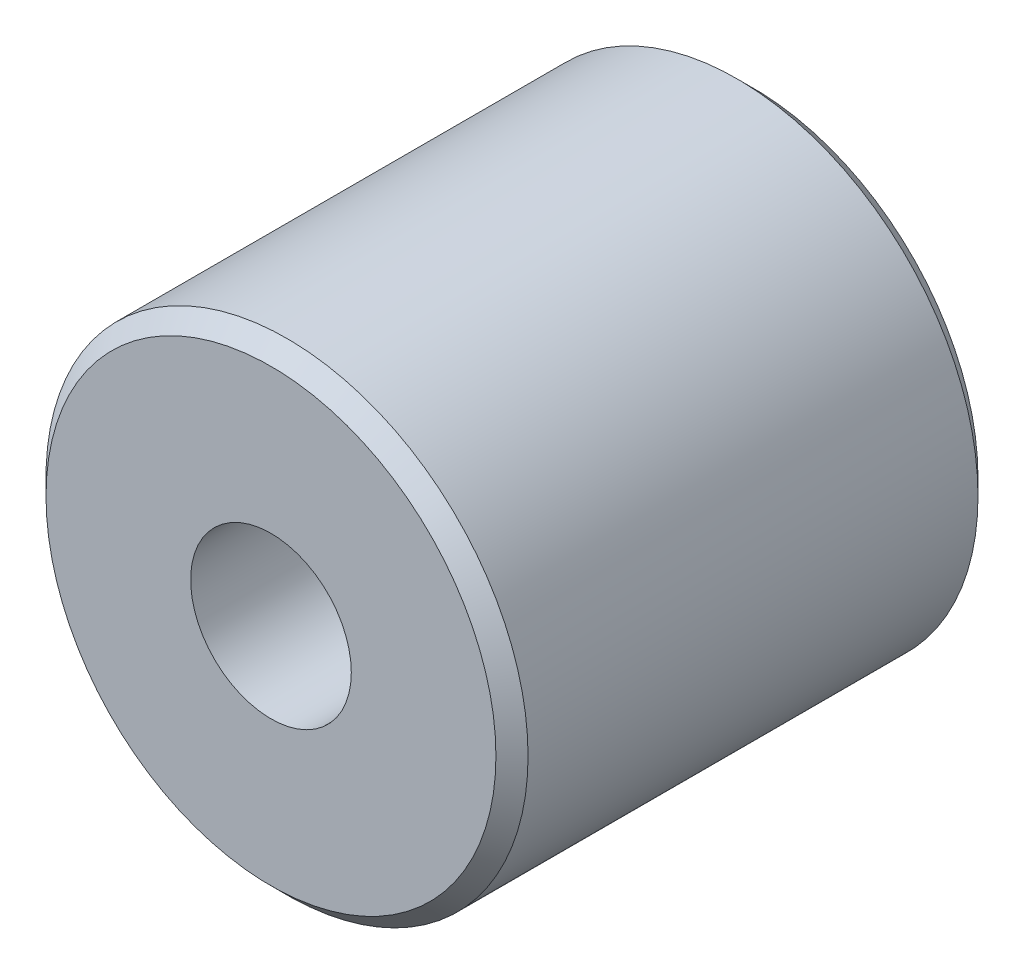
ISO-10303-21;
HEADER;
FILE_DESCRIPTION(('STEP AP214'),'2;1');
FILE_NAME('part.step','',(''),(''),'','','');
FILE_SCHEMA(('AUTOMOTIVE_DESIGN { 1 0 10303 214 1 1 1 1 }'));
ENDSEC;
DATA;
#1=APPLICATION_CONTEXT('core data for automotive mechanical design processes');
#2=APPLICATION_PROTOCOL_DEFINITION('international standard','automotive_design',2000,#1);
#3=PRODUCT_CONTEXT('',#1,'mechanical');
#4=PRODUCT('Part','Part','',(#3));
#5=PRODUCT_RELATED_PRODUCT_CATEGORY('part','',(#4));
#6=PRODUCT_DEFINITION_FORMATION('','',#4);
#7=PRODUCT_DEFINITION_CONTEXT('part definition',#1,'design');
#8=PRODUCT_DEFINITION('design','',#6,#7);
#9=PRODUCT_DEFINITION_SHAPE('','',#8);
#10=(LENGTH_UNIT() NAMED_UNIT(*) SI_UNIT(.MILLI.,.METRE.));
#11=(NAMED_UNIT(*) PLANE_ANGLE_UNIT() SI_UNIT($,.RADIAN.));
#12=(NAMED_UNIT(*) SI_UNIT($,.STERADIAN.) SOLID_ANGLE_UNIT());
#13=UNCERTAINTY_MEASURE_WITH_UNIT(LENGTH_MEASURE(1.E-05),#10,'distance_accuracy_value','');
#14=(GEOMETRIC_REPRESENTATION_CONTEXT(3) GLOBAL_UNCERTAINTY_ASSIGNED_CONTEXT((#13)) GLOBAL_UNIT_ASSIGNED_CONTEXT((#10,
#11,#12)) REPRESENTATION_CONTEXT('',''));
#15=CARTESIAN_POINT('',(0.,0.,0.));
#16=DIRECTION('',(0.,0.,1.));
#17=DIRECTION('',(1.,0.,0.));
#18=AXIS2_PLACEMENT_3D('',#15,#16,#17);
#19=CARTESIAN_POINT('',(0.,0.,30.));
#20=DIRECTION('',(0.,0.,1.));
#21=DIRECTION('',(1.,0.,0.));
#22=AXIS2_PLACEMENT_3D('',#19,#20,#21);
#23=PLANE('',#22);
#24=CARTESIAN_POINT('',(0.,0.,30.));
#25=DIRECTION('',(0.,0.,1.));
#26=DIRECTION('',(1.,0.,0.));
#27=AXIS2_PLACEMENT_3D('',#24,#25,#26);
#28=CIRCLE('',#27,14.);
#29=CARTESIAN_POINT('',(14.,0.,30.));
#30=VERTEX_POINT('',#29);
#31=EDGE_CURVE('E10',#30,#30,#28,.T.);
#32=ORIENTED_EDGE('',*,*,#31,.T.);
#33=EDGE_LOOP('',(#32));
#34=FACE_BOUND('',#33,.T.);
#35=CARTESIAN_POINT('',(0.,0.,30.));
#36=DIRECTION('',(0.,0.,1.));
#37=DIRECTION('',(1.,0.,0.));
#38=AXIS2_PLACEMENT_3D('',#35,#36,#37);
#39=CIRCLE('',#38,5.);
#40=CARTESIAN_POINT('',(5.,0.,30.));
#41=VERTEX_POINT('',#40);
#42=EDGE_CURVE('E51',#41,#41,#39,.T.);
#43=ORIENTED_EDGE('',*,*,#42,.F.);
#44=EDGE_LOOP('',(#43));
#45=FACE_BOUND('',#44,.T.);
#46=ADVANCED_FACE('F31',(#34,#45),#23,.T.);
#47=CARTESIAN_POINT('',(0.,0.,0.));
#48=DIRECTION('',(0.,0.,1.));
#49=DIRECTION('',(1.,0.,0.));
#50=AXIS2_PLACEMENT_3D('',#47,#48,#49);
#51=PLANE('',#50);
#52=CARTESIAN_POINT('',(0.,0.,0.));
#53=DIRECTION('',(0.,0.,1.));
#54=DIRECTION('',(1.,0.,0.));
#55=AXIS2_PLACEMENT_3D('',#52,#53,#54);
#56=CIRCLE('',#55,14.);
#57=CARTESIAN_POINT('',(14.,0.,0.));
#58=VERTEX_POINT('',#57);
#59=EDGE_CURVE('E38',#58,#58,#56,.F.);
#60=ORIENTED_EDGE('',*,*,#59,.T.);
#61=EDGE_LOOP('',(#60));
#62=FACE_BOUND('',#61,.T.);
#63=CARTESIAN_POINT('',(0.,0.,0.));
#64=DIRECTION('',(0.,0.,1.));
#65=DIRECTION('',(1.,0.,0.));
#66=AXIS2_PLACEMENT_3D('',#63,#64,#65);
#67=CIRCLE('',#66,5.);
#68=CARTESIAN_POINT('',(5.,0.,0.));
#69=VERTEX_POINT('',#68);
#70=EDGE_CURVE('E52',#69,#69,#67,.T.);
#71=ORIENTED_EDGE('',*,*,#70,.T.);
#72=EDGE_LOOP('',(#71));
#73=FACE_BOUND('',#72,.T.);
#74=ADVANCED_FACE('F62',(#62,#73),#51,.F.);
#75=CARTESIAN_POINT('',(0.,0.,30.));
#76=DIRECTION('',(0.,0.,-1.));
#77=DIRECTION('',(-1.,0.,0.));
#78=AXIS2_PLACEMENT_3D('',#75,#76,#77);
#79=CYLINDRICAL_SURFACE('',#78,15.);
#80=CARTESIAN_POINT('',(0.,0.,1.));
#81=DIRECTION('',(0.,0.,1.));
#82=DIRECTION('',(1.,0.,0.));
#83=AXIS2_PLACEMENT_3D('',#80,#81,#82);
#84=CIRCLE('',#83,15.);
#85=CARTESIAN_POINT('',(15.,0.,1.));
#86=VERTEX_POINT('',#85);
#87=EDGE_CURVE('E42',#86,#86,#84,.T.);
#88=ORIENTED_EDGE('',*,*,#87,.T.);
#89=EDGE_LOOP('',(#88));
#90=FACE_BOUND('',#89,.T.);
#91=CARTESIAN_POINT('',(0.,0.,29.));
#92=DIRECTION('',(0.,0.,1.));
#93=DIRECTION('',(1.,0.,0.));
#94=AXIS2_PLACEMENT_3D('',#91,#92,#93);
#95=CIRCLE('',#94,15.);
#96=CARTESIAN_POINT('',(15.,0.,29.));
#97=VERTEX_POINT('',#96);
#98=EDGE_CURVE('E46',#97,#97,#95,.F.);
#99=ORIENTED_EDGE('',*,*,#98,.T.);
#100=EDGE_LOOP('',(#99));
#101=FACE_BOUND('',#100,.T.);
#102=ADVANCED_FACE('F67',(#90,#101),#79,.T.);
#103=CARTESIAN_POINT('',(0.,0.,30.));
#104=DIRECTION('',(0.,0.,-1.));
#105=DIRECTION('',(-1.,0.,0.));
#106=AXIS2_PLACEMENT_3D('',#103,#104,#105);
#107=CYLINDRICAL_SURFACE('',#106,5.);
#108=ORIENTED_EDGE('',*,*,#42,.T.);
#109=EDGE_LOOP('',(#108));
#110=FACE_BOUND('',#109,.T.);
#111=ORIENTED_EDGE('',*,*,#70,.F.);
#112=EDGE_LOOP('',(#111));
#113=FACE_BOUND('',#112,.T.);
#114=ADVANCED_FACE('F58',(#110,#113),#107,.F.);
#115=CARTESIAN_POINT('',(0.,0.,1.));
#116=DIRECTION('',(0.,0.,1.));
#117=DIRECTION('',(1.,0.,0.));
#118=AXIS2_PLACEMENT_3D('',#115,#116,#117);
#119=CONICAL_SURFACE('',#118,15.,0.785398163397449);
#120=ORIENTED_EDGE('',*,*,#59,.F.);
#121=EDGE_LOOP('',(#120));
#122=FACE_BOUND('',#121,.T.);
#123=ORIENTED_EDGE('',*,*,#87,.F.);
#124=EDGE_LOOP('',(#123));
#125=FACE_BOUND('',#124,.T.);
#126=ADVANCED_FACE('F73',(#122,#125),#119,.T.);
#127=CARTESIAN_POINT('',(0.,0.,30.));
#128=DIRECTION('',(0.,0.,-1.));
#129=DIRECTION('',(-1.,0.,0.));
#130=AXIS2_PLACEMENT_3D('',#127,#128,#129);
#131=CONICAL_SURFACE('',#130,14.,0.785398163397446);
#132=ORIENTED_EDGE('',*,*,#98,.F.);
#133=EDGE_LOOP('',(#132));
#134=FACE_BOUND('',#133,.T.);
#135=ORIENTED_EDGE('',*,*,#31,.F.);
#136=EDGE_LOOP('',(#135));
#137=FACE_BOUND('',#136,.T.);
#138=ADVANCED_FACE('F33',(#134,#137),#131,.T.);
#139=CLOSED_SHELL('',(#46,#74,#102,#114,#126,#138));
#140=MANIFOLD_SOLID_BREP('B2',#139);
#141=ADVANCED_BREP_SHAPE_REPRESENTATION('',(#18,#140),#14);
#142=SHAPE_DEFINITION_REPRESENTATION(#9,#141);
ENDSEC;
END-ISO-10303-21;
